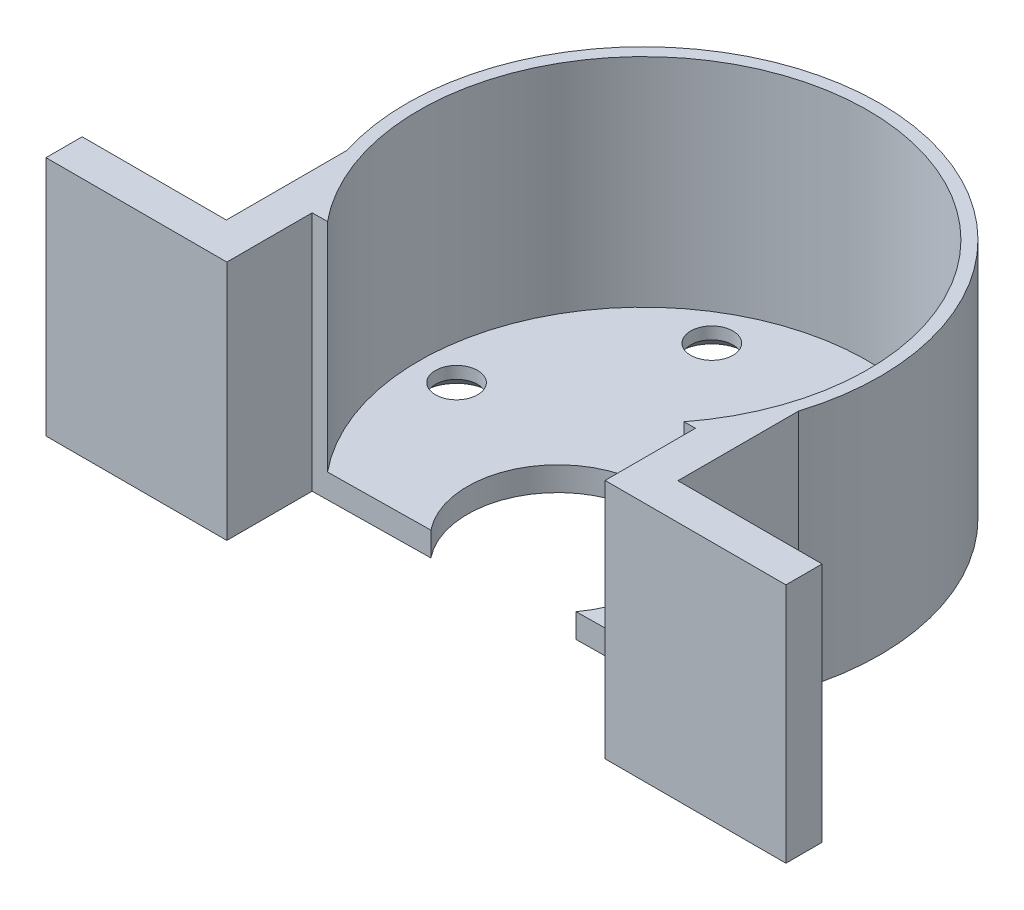
ISO-10303-21;
HEADER;
FILE_DESCRIPTION(('STEP AP214'),'2;1');
FILE_NAME('part.step','',(''),(''),'','','');
FILE_SCHEMA(('AUTOMOTIVE_DESIGN { 1 0 10303 214 1 1 1 1 }'));
ENDSEC;
DATA;
#1=APPLICATION_CONTEXT('core data for automotive mechanical design processes');
#2=APPLICATION_PROTOCOL_DEFINITION('international standard','automotive_design',2000,#1);
#3=PRODUCT_CONTEXT('',#1,'mechanical');
#4=PRODUCT('Part','Part','',(#3));
#5=PRODUCT_RELATED_PRODUCT_CATEGORY('part','',(#4));
#6=PRODUCT_DEFINITION_FORMATION('','',#4);
#7=PRODUCT_DEFINITION_CONTEXT('part definition',#1,'design');
#8=PRODUCT_DEFINITION('design','',#6,#7);
#9=PRODUCT_DEFINITION_SHAPE('','',#8);
#10=(LENGTH_UNIT() NAMED_UNIT(*) SI_UNIT(.MILLI.,.METRE.));
#11=(NAMED_UNIT(*) PLANE_ANGLE_UNIT() SI_UNIT($,.RADIAN.));
#12=(NAMED_UNIT(*) SI_UNIT($,.STERADIAN.) SOLID_ANGLE_UNIT());
#13=UNCERTAINTY_MEASURE_WITH_UNIT(LENGTH_MEASURE(1.E-05),#10,'distance_accuracy_value','');
#14=(GEOMETRIC_REPRESENTATION_CONTEXT(3) GLOBAL_UNCERTAINTY_ASSIGNED_CONTEXT((#13)) GLOBAL_UNIT_ASSIGNED_CONTEXT((#10,
#11,#12)) REPRESENTATION_CONTEXT('',''));
#15=CARTESIAN_POINT('',(0.,0.,0.));
#16=DIRECTION('',(0.,0.,1.));
#17=DIRECTION('',(1.,0.,0.));
#18=AXIS2_PLACEMENT_3D('',#15,#16,#17);
#19=CARTESIAN_POINT('',(0.,0.,0.));
#20=DIRECTION('',(0.,1.,0.));
#21=DIRECTION('',(0.,0.,1.));
#22=AXIS2_PLACEMENT_3D('',#19,#20,#21);
#23=PLANE('',#22);
#24=CARTESIAN_POINT('',(7.74999999999992,0.,-13.4233937586588));
#25=DIRECTION('',(0.,-1.,0.));
#26=DIRECTION('',(0.,0.,-1.));
#27=AXIS2_PLACEMENT_3D('',#24,#25,#26);
#28=CIRCLE('',#27,2.75);
#29=CARTESIAN_POINT('',(7.74999999999992,0.,-16.1733937586588));
#30=VERTEX_POINT('',#29);
#31=EDGE_CURVE('E609',#30,#30,#28,.T.);
#32=ORIENTED_EDGE('',*,*,#31,.F.);
#33=EDGE_LOOP('',(#32));
#34=FACE_BOUND('',#33,.T.);
#35=CARTESIAN_POINT('',(-7.75,0.,-13.4233937586597));
#36=DIRECTION('',(0.,-1.,0.));
#37=DIRECTION('',(0.,0.,-1.));
#38=AXIS2_PLACEMENT_3D('',#35,#36,#37);
#39=CIRCLE('',#38,2.75);
#40=CARTESIAN_POINT('',(-7.75,0.,-16.1733937586597));
#41=VERTEX_POINT('',#40);
#42=EDGE_CURVE('E252',#41,#41,#39,.T.);
#43=ORIENTED_EDGE('',*,*,#42,.F.);
#44=EDGE_LOOP('',(#43));
#45=FACE_BOUND('',#44,.T.);
#46=DIRECTION('',(0.999908014906101,0.,-0.0135632491144308));
#47=VECTOR('',#46,1.);
#48=CARTESIAN_POINT('',(0.157041345134713,0.,11.577380784429));
#49=LINE('',#48,#47);
#50=CARTESIAN_POINT('',(5.90549403913248,0.,11.4994059159922));
#51=VERTEX_POINT('',#50);
#52=CARTESIAN_POINT('',(15.6870120515816,0.,11.3667245457637));
#53=VERTEX_POINT('',#52);
#54=EDGE_CURVE('E168',#51,#53,#49,.T.);
#55=ORIENTED_EDGE('',*,*,#54,.F.);
#56=CARTESIAN_POINT('',(-0.0949514779216288,0.,7.00000000000001));
#57=DIRECTION('',(0.,1.,0.));
#58=DIRECTION('',(0.,0.,-1.));
#59=AXIS2_PLACEMENT_3D('',#56,#57,#58);
#60=CIRCLE('',#59,7.5);
#61=CARTESIAN_POINT('',(-5.97114739079831,0.,11.6605065812089));
#62=VERTEX_POINT('',#61);
#63=EDGE_CURVE('E153',#51,#62,#60,.T.);
#64=ORIENTED_EDGE('',*,*,#63,.T.);
#65=CARTESIAN_POINT('',(-15.6870120515816,0.,11.7922973967557));
#66=VERTEX_POINT('',#65);
#67=EDGE_CURVE('E165',#66,#62,#49,.T.);
#68=ORIENTED_EDGE('',*,*,#67,.F.);
#69=DIRECTION('',(0.,0.,1.));
#70=VECTOR('',#69,1.);
#71=CARTESIAN_POINT('',(-15.6870120515816,0.,0.));
#72=LINE('',#71,#70);
#73=CARTESIAN_POINT('',(-15.6870120515816,0.,18.8658479697375));
#74=VERTEX_POINT('',#73);
#75=EDGE_CURVE('E178',#66,#74,#72,.T.);
#76=ORIENTED_EDGE('',*,*,#75,.T.);
#77=DIRECTION('',(1.,0.,0.));
#78=VECTOR('',#77,1.);
#79=CARTESIAN_POINT('',(0.,0.,18.8658479697375));
#80=LINE('',#79,#78);
#81=CARTESIAN_POINT('',(-30.6870120515816,0.,18.8658479697375));
#82=VERTEX_POINT('',#81);
#83=EDGE_CURVE('E203',#82,#74,#80,.T.);
#84=ORIENTED_EDGE('',*,*,#83,.F.);
#85=DIRECTION('',(0.,0.,1.));
#86=VECTOR('',#85,1.);
#87=CARTESIAN_POINT('',(-30.6870120515816,0.,0.));
#88=LINE('',#87,#86);
#89=CARTESIAN_POINT('',(-30.6870120515816,0.,15.8658479697375));
#90=VERTEX_POINT('',#89);
#91=EDGE_CURVE('E201',#90,#82,#88,.T.);
#92=ORIENTED_EDGE('',*,*,#91,.F.);
#93=DIRECTION('',(-1.,0.,0.));
#94=VECTOR('',#93,1.);
#95=CARTESIAN_POINT('',(0.,0.,15.8658479697375));
#96=LINE('',#95,#94);
#97=CARTESIAN_POINT('',(-18.7278523220343,0.,15.8658479697375));
#98=VERTEX_POINT('',#97);
#99=EDGE_CURVE('E199',#98,#90,#96,.T.);
#100=ORIENTED_EDGE('',*,*,#99,.F.);
#101=DIRECTION('',(0.,0.,-1.));
#102=VECTOR('',#101,1.);
#103=CARTESIAN_POINT('',(-18.7278523220343,0.,0.));
#104=LINE('',#103,#102);
#105=CARTESIAN_POINT('',(-18.7278523220343,0.,5.86584796973752));
#106=VERTEX_POINT('',#105);
#107=EDGE_CURVE('E196',#98,#106,#104,.T.);
#108=ORIENTED_EDGE('',*,*,#107,.T.);
#109=CARTESIAN_POINT('',(0.,0.,0.));
#110=DIRECTION('',(0.,1.,0.));
#111=DIRECTION('',(0.,0.,1.));
#112=AXIS2_PLACEMENT_3D('',#109,#110,#111);
#113=CIRCLE('',#112,19.625);
#114=CARTESIAN_POINT('',(18.7278523220343,0.,5.86584796973752));
#115=VERTEX_POINT('',#114);
#116=EDGE_CURVE('E193',#115,#106,#113,.T.);
#117=ORIENTED_EDGE('',*,*,#116,.F.);
#118=DIRECTION('',(0.,0.,1.));
#119=VECTOR('',#118,1.);
#120=CARTESIAN_POINT('',(18.7278523220343,0.,0.));
#121=LINE('',#120,#119);
#122=CARTESIAN_POINT('',(18.7278523220343,0.,15.8658479697375));
#123=VERTEX_POINT('',#122);
#124=EDGE_CURVE('E190',#115,#123,#121,.T.);
#125=ORIENTED_EDGE('',*,*,#124,.T.);
#126=DIRECTION('',(1.,0.,0.));
#127=VECTOR('',#126,1.);
#128=CARTESIAN_POINT('',(0.,0.,15.8658479697375));
#129=LINE('',#128,#127);
#130=CARTESIAN_POINT('',(30.6870120515816,0.,15.8658479697375));
#131=VERTEX_POINT('',#130);
#132=EDGE_CURVE('E187',#123,#131,#129,.T.);
#133=ORIENTED_EDGE('',*,*,#132,.T.);
#134=DIRECTION('',(0.,0.,-1.));
#135=VECTOR('',#134,1.);
#136=CARTESIAN_POINT('',(30.6870120515816,0.,0.));
#137=LINE('',#136,#135);
#138=CARTESIAN_POINT('',(30.6870120515816,0.,18.8658479697375));
#139=VERTEX_POINT('',#138);
#140=EDGE_CURVE('E184',#139,#131,#137,.T.);
#141=ORIENTED_EDGE('',*,*,#140,.F.);
#142=DIRECTION('',(-1.,0.,0.));
#143=VECTOR('',#142,1.);
#144=CARTESIAN_POINT('',(0.,0.,18.8658479697375));
#145=LINE('',#144,#143);
#146=CARTESIAN_POINT('',(15.6870120515816,0.,18.8658479697375));
#147=VERTEX_POINT('',#146);
#148=EDGE_CURVE('E176',#139,#147,#145,.T.);
#149=ORIENTED_EDGE('',*,*,#148,.T.);
#150=DIRECTION('',(0.,0.,-1.));
#151=VECTOR('',#150,1.);
#152=CARTESIAN_POINT('',(15.6870120515816,0.,0.));
#153=LINE('',#152,#151);
#154=EDGE_CURVE('E174',#147,#53,#153,.T.);
#155=ORIENTED_EDGE('',*,*,#154,.T.);
#156=EDGE_LOOP('',(#55,#64,#68,#76,#84,#92,#100,#108,#117,#125,#133,#141,#149,#155));
#157=FACE_BOUND('',#156,.T.);
#158=CARTESIAN_POINT('',(15.4999999999992,0.,4.54598544954157E-13));
#159=DIRECTION('',(0.,-1.,0.));
#160=DIRECTION('',(0.,0.,-1.));
#161=AXIS2_PLACEMENT_3D('',#158,#159,#160);
#162=CIRCLE('',#161,2.75);
#163=CARTESIAN_POINT('',(15.4999999999992,0.,-2.74999999999954));
#164=VERTEX_POINT('',#163);
#165=EDGE_CURVE('E241',#164,#164,#162,.T.);
#166=ORIENTED_EDGE('',*,*,#165,.F.);
#167=EDGE_LOOP('',(#166));
#168=FACE_BOUND('',#167,.T.);
#169=CARTESIAN_POINT('',(-15.5000000000008,0.,-1.30721513339676E-12));
#170=DIRECTION('',(0.,-1.,0.));
#171=DIRECTION('',(0.,0.,-1.));
#172=AXIS2_PLACEMENT_3D('',#169,#170,#171);
#173=CIRCLE('',#172,2.75);
#174=CARTESIAN_POINT('',(-15.5000000000008,0.,-2.75000000000131));
#175=VERTEX_POINT('',#174);
#176=EDGE_CURVE('E245',#175,#175,#173,.T.);
#177=ORIENTED_EDGE('',*,*,#176,.F.);
#178=EDGE_LOOP('',(#177));
#179=FACE_BOUND('',#178,.T.);
#180=ADVANCED_FACE('F37',(#34,#45,#157,#168,#179),#23,.F.);
#181=CARTESIAN_POINT('',(0.157041345134713,20.,11.577380784429));
#182=DIRECTION('',(-0.0135632491144308,0.,-0.999908014906101));
#183=DIRECTION('',(-0.999908014906101,0.,0.0135632491144308));
#184=AXIS2_PLACEMENT_3D('',#181,#182,#183);
#185=PLANE('',#184);
#186=ORIENTED_EDGE('',*,*,#67,.T.);
#187=DIRECTION('',(0.,1.,0.));
#188=VECTOR('',#187,1.);
#189=CARTESIAN_POINT('',(-5.97114739079831,0.,11.6605065812089));
#190=LINE('',#189,#188);
#191=CARTESIAN_POINT('',(-5.97114739079831,2.,11.6605065812089));
#192=VERTEX_POINT('',#191);
#193=EDGE_CURVE('E150',#62,#192,#190,.T.);
#194=ORIENTED_EDGE('',*,*,#193,.T.);
#195=DIRECTION('',(0.999908014906101,0.,-0.0135632491144308));
#196=VECTOR('',#195,1.);
#197=CARTESIAN_POINT('',(0.157041345134713,2.,11.577380784429));
#198=LINE('',#197,#196);
#199=CARTESIAN_POINT('',(-14.4303184082284,2.,11.7752509797942));
#200=VERTEX_POINT('',#199);
#201=EDGE_CURVE('E46',#200,#192,#198,.T.);
#202=ORIENTED_EDGE('',*,*,#201,.F.);
#203=DIRECTION('',(0.,1.,0.));
#204=VECTOR('',#203,1.);
#205=CARTESIAN_POINT('',(-14.4303184082284,2.,11.7752509797942));
#206=LINE('',#205,#204);
#207=CARTESIAN_POINT('',(-14.4303184082284,20.,11.7752509797942));
#208=VERTEX_POINT('',#207);
#209=EDGE_CURVE('E272',#200,#208,#206,.T.);
#210=ORIENTED_EDGE('',*,*,#209,.T.);
#211=DIRECTION('',(0.999908014906101,0.,-0.0135632491144308));
#212=VECTOR('',#211,1.);
#213=CARTESIAN_POINT('',(0.157041345134713,20.,11.577380784429));
#214=LINE('',#213,#212);
#215=CARTESIAN_POINT('',(-15.6870120515816,20.,11.7922973967557));
#216=VERTEX_POINT('',#215);
#217=EDGE_CURVE('E278',#216,#208,#214,.T.);
#218=ORIENTED_EDGE('',*,*,#217,.F.);
#219=DIRECTION('',(0.,-1.,0.));
#220=VECTOR('',#219,1.);
#221=CARTESIAN_POINT('',(-15.6870120515816,20.,11.7922973967557));
#222=LINE('',#221,#220);
#223=EDGE_CURVE('E173',#216,#66,#222,.T.);
#224=ORIENTED_EDGE('',*,*,#223,.T.);
#225=EDGE_LOOP('',(#186,#194,#202,#210,#218,#224));
#226=FACE_BOUND('',#225,.T.);
#227=ADVANCED_FACE('F171',(#226),#185,.F.);
#228=CARTESIAN_POINT('',(-15.6870120515816,20.,0.));
#229=DIRECTION('',(1.,0.,0.));
#230=DIRECTION('',(0.,0.,-1.));
#231=AXIS2_PLACEMENT_3D('',#228,#229,#230);
#232=PLANE('',#231);
#233=ORIENTED_EDGE('',*,*,#75,.F.);
#234=ORIENTED_EDGE('',*,*,#223,.F.);
#235=DIRECTION('',(0.,0.,1.));
#236=VECTOR('',#235,1.);
#237=CARTESIAN_POINT('',(-15.6870120515816,20.,0.));
#238=LINE('',#237,#236);
#239=CARTESIAN_POINT('',(-15.6870120515816,20.,18.8658479697375));
#240=VERTEX_POINT('',#239);
#241=EDGE_CURVE('E206',#216,#240,#238,.T.);
#242=ORIENTED_EDGE('',*,*,#241,.T.);
#243=DIRECTION('',(0.,-1.,0.));
#244=VECTOR('',#243,1.);
#245=CARTESIAN_POINT('',(-15.6870120515816,20.,18.8658479697375));
#246=LINE('',#245,#244);
#247=EDGE_CURVE('E207',#240,#74,#246,.T.);
#248=ORIENTED_EDGE('',*,*,#247,.T.);
#249=EDGE_LOOP('',(#233,#234,#242,#248));
#250=FACE_BOUND('',#249,.T.);
#251=ADVANCED_FACE('F39',(#250),#232,.T.);
#252=CARTESIAN_POINT('',(5.90549403913248,2.,11.4994059159922));
#253=VERTEX_POINT('',#252);
#254=CARTESIAN_POINT('',(14.7444010984979,2.,11.3795105890638));
#255=VERTEX_POINT('',#254);
#256=EDGE_CURVE('E234',#253,#255,#198,.T.);
#257=ORIENTED_EDGE('',*,*,#256,.F.);
#258=DIRECTION('',(0.,1.,0.));
#259=VECTOR('',#258,1.);
#260=CARTESIAN_POINT('',(5.90549403913248,0.,11.4994059159922));
#261=LINE('',#260,#259);
#262=EDGE_CURVE('E53',#253,#51,#261,.F.);
#263=ORIENTED_EDGE('',*,*,#262,.T.);
#264=ORIENTED_EDGE('',*,*,#54,.T.);
#265=DIRECTION('',(0.,-1.,0.));
#266=VECTOR('',#265,1.);
#267=CARTESIAN_POINT('',(15.6870120515816,20.,11.3667245457637));
#268=LINE('',#267,#266);
#269=CARTESIAN_POINT('',(15.6870120515816,20.,11.3667245457637));
#270=VERTEX_POINT('',#269);
#271=EDGE_CURVE('E230',#270,#53,#268,.T.);
#272=ORIENTED_EDGE('',*,*,#271,.F.);
#273=CARTESIAN_POINT('',(14.7444010984979,20.,11.3795105890638));
#274=VERTEX_POINT('',#273);
#275=EDGE_CURVE('E277',#274,#270,#214,.T.);
#276=ORIENTED_EDGE('',*,*,#275,.F.);
#277=DIRECTION('',(0.,1.,0.));
#278=VECTOR('',#277,1.);
#279=CARTESIAN_POINT('',(14.7444010984979,2.,11.3795105890638));
#280=LINE('',#279,#278);
#281=EDGE_CURVE('E61',#274,#255,#280,.F.);
#282=ORIENTED_EDGE('',*,*,#281,.T.);
#283=EDGE_LOOP('',(#257,#263,#264,#272,#276,#282));
#284=FACE_BOUND('',#283,.T.);
#285=ADVANCED_FACE('F319',(#284),#185,.F.);
#286=CARTESIAN_POINT('',(15.6870120515816,20.,0.));
#287=DIRECTION('',(-1.,0.,0.));
#288=DIRECTION('',(0.,0.,1.));
#289=AXIS2_PLACEMENT_3D('',#286,#287,#288);
#290=PLANE('',#289);
#291=ORIENTED_EDGE('',*,*,#154,.F.);
#292=DIRECTION('',(0.,-1.,0.));
#293=VECTOR('',#292,1.);
#294=CARTESIAN_POINT('',(15.6870120515816,20.,18.8658479697375));
#295=LINE('',#294,#293);
#296=CARTESIAN_POINT('',(15.6870120515816,20.,18.8658479697375));
#297=VERTEX_POINT('',#296);
#298=EDGE_CURVE('E228',#297,#147,#295,.T.);
#299=ORIENTED_EDGE('',*,*,#298,.F.);
#300=DIRECTION('',(0.,0.,-1.));
#301=VECTOR('',#300,1.);
#302=CARTESIAN_POINT('',(15.6870120515816,20.,0.));
#303=LINE('',#302,#301);
#304=EDGE_CURVE('E281',#297,#270,#303,.T.);
#305=ORIENTED_EDGE('',*,*,#304,.T.);
#306=ORIENTED_EDGE('',*,*,#271,.T.);
#307=EDGE_LOOP('',(#291,#299,#305,#306));
#308=FACE_BOUND('',#307,.T.);
#309=ADVANCED_FACE('F322',(#308),#290,.T.);
#310=CARTESIAN_POINT('',(0.,20.,18.8658479697375));
#311=DIRECTION('',(0.,0.,1.));
#312=DIRECTION('',(1.,0.,0.));
#313=AXIS2_PLACEMENT_3D('',#310,#311,#312);
#314=PLANE('',#313);
#315=ORIENTED_EDGE('',*,*,#148,.F.);
#316=DIRECTION('',(0.,-1.,0.));
#317=VECTOR('',#316,1.);
#318=CARTESIAN_POINT('',(30.6870120515816,20.,18.8658479697375));
#319=LINE('',#318,#317);
#320=CARTESIAN_POINT('',(30.6870120515816,20.,18.8658479697375));
#321=VERTEX_POINT('',#320);
#322=EDGE_CURVE('E226',#321,#139,#319,.T.);
#323=ORIENTED_EDGE('',*,*,#322,.F.);
#324=DIRECTION('',(-1.,0.,0.));
#325=VECTOR('',#324,1.);
#326=CARTESIAN_POINT('',(0.,20.,18.8658479697375));
#327=LINE('',#326,#325);
#328=EDGE_CURVE('E284',#321,#297,#327,.T.);
#329=ORIENTED_EDGE('',*,*,#328,.T.);
#330=ORIENTED_EDGE('',*,*,#298,.T.);
#331=EDGE_LOOP('',(#315,#323,#329,#330));
#332=FACE_BOUND('',#331,.T.);
#333=ADVANCED_FACE('F326',(#332),#314,.T.);
#334=CARTESIAN_POINT('',(30.6870120515816,20.,0.));
#335=DIRECTION('',(-1.,0.,0.));
#336=DIRECTION('',(0.,0.,1.));
#337=AXIS2_PLACEMENT_3D('',#334,#335,#336);
#338=PLANE('',#337);
#339=ORIENTED_EDGE('',*,*,#140,.T.);
#340=DIRECTION('',(0.,-1.,0.));
#341=VECTOR('',#340,1.);
#342=CARTESIAN_POINT('',(30.6870120515816,20.,15.8658479697375));
#343=LINE('',#342,#341);
#344=CARTESIAN_POINT('',(30.6870120515816,20.,15.8658479697375));
#345=VERTEX_POINT('',#344);
#346=EDGE_CURVE('E224',#345,#131,#343,.T.);
#347=ORIENTED_EDGE('',*,*,#346,.F.);
#348=DIRECTION('',(0.,0.,-1.));
#349=VECTOR('',#348,1.);
#350=CARTESIAN_POINT('',(30.6870120515816,20.,0.));
#351=LINE('',#350,#349);
#352=EDGE_CURVE('E287',#321,#345,#351,.T.);
#353=ORIENTED_EDGE('',*,*,#352,.F.);
#354=ORIENTED_EDGE('',*,*,#322,.T.);
#355=EDGE_LOOP('',(#339,#347,#353,#354));
#356=FACE_BOUND('',#355,.T.);
#357=ADVANCED_FACE('F331',(#356),#338,.F.);
#358=CARTESIAN_POINT('',(0.,20.,15.8658479697375));
#359=DIRECTION('',(0.,0.,-1.));
#360=DIRECTION('',(-1.,0.,0.));
#361=AXIS2_PLACEMENT_3D('',#358,#359,#360);
#362=PLANE('',#361);
#363=ORIENTED_EDGE('',*,*,#132,.F.);
#364=DIRECTION('',(0.,-1.,0.));
#365=VECTOR('',#364,1.);
#366=CARTESIAN_POINT('',(18.7278523220343,20.,15.8658479697375));
#367=LINE('',#366,#365);
#368=CARTESIAN_POINT('',(18.7278523220343,20.,15.8658479697375));
#369=VERTEX_POINT('',#368);
#370=EDGE_CURVE('E222',#369,#123,#367,.T.);
#371=ORIENTED_EDGE('',*,*,#370,.F.);
#372=DIRECTION('',(1.,0.,0.));
#373=VECTOR('',#372,1.);
#374=CARTESIAN_POINT('',(0.,20.,15.8658479697375));
#375=LINE('',#374,#373);
#376=EDGE_CURVE('E289',#369,#345,#375,.T.);
#377=ORIENTED_EDGE('',*,*,#376,.T.);
#378=ORIENTED_EDGE('',*,*,#346,.T.);
#379=EDGE_LOOP('',(#363,#371,#377,#378));
#380=FACE_BOUND('',#379,.T.);
#381=ADVANCED_FACE('F356',(#380),#362,.T.);
#382=CARTESIAN_POINT('',(18.7278523220343,20.,0.));
#383=DIRECTION('',(1.,0.,0.));
#384=DIRECTION('',(0.,0.,-1.));
#385=AXIS2_PLACEMENT_3D('',#382,#383,#384);
#386=PLANE('',#385);
#387=ORIENTED_EDGE('',*,*,#124,.F.);
#388=DIRECTION('',(0.,-1.,0.));
#389=VECTOR('',#388,1.);
#390=CARTESIAN_POINT('',(18.7278523220343,20.,5.86584796973752));
#391=LINE('',#390,#389);
#392=CARTESIAN_POINT('',(18.7278523220343,20.,5.86584796973752));
#393=VERTEX_POINT('',#392);
#394=EDGE_CURVE('E220',#393,#115,#391,.T.);
#395=ORIENTED_EDGE('',*,*,#394,.F.);
#396=DIRECTION('',(0.,0.,1.));
#397=VECTOR('',#396,1.);
#398=CARTESIAN_POINT('',(18.7278523220343,20.,0.));
#399=LINE('',#398,#397);
#400=EDGE_CURVE('E292',#393,#369,#399,.T.);
#401=ORIENTED_EDGE('',*,*,#400,.T.);
#402=ORIENTED_EDGE('',*,*,#370,.T.);
#403=EDGE_LOOP('',(#387,#395,#401,#402));
#404=FACE_BOUND('',#403,.T.);
#405=ADVANCED_FACE('F337',(#404),#386,.T.);
#406=CARTESIAN_POINT('',(0.,20.,0.));
#407=DIRECTION('',(0.,-1.,0.));
#408=DIRECTION('',(0.,0.,-1.));
#409=AXIS2_PLACEMENT_3D('',#406,#407,#408);
#410=CYLINDRICAL_SURFACE('',#409,19.625);
#411=ORIENTED_EDGE('',*,*,#116,.T.);
#412=DIRECTION('',(0.,-1.,0.));
#413=VECTOR('',#412,1.);
#414=CARTESIAN_POINT('',(-18.7278523220343,20.,5.86584796973752));
#415=LINE('',#414,#413);
#416=CARTESIAN_POINT('',(-18.7278523220343,20.,5.86584796973752));
#417=VERTEX_POINT('',#416);
#418=EDGE_CURVE('E218',#417,#106,#415,.T.);
#419=ORIENTED_EDGE('',*,*,#418,.F.);
#420=CARTESIAN_POINT('',(0.,20.,0.));
#421=DIRECTION('',(0.,1.,0.));
#422=DIRECTION('',(0.,0.,1.));
#423=AXIS2_PLACEMENT_3D('',#420,#421,#422);
#424=CIRCLE('',#423,19.625);
#425=EDGE_CURVE('E295',#393,#417,#424,.T.);
#426=ORIENTED_EDGE('',*,*,#425,.F.);
#427=ORIENTED_EDGE('',*,*,#394,.T.);
#428=EDGE_LOOP('',(#411,#419,#426,#427));
#429=FACE_BOUND('',#428,.T.);
#430=ADVANCED_FACE('F343',(#429),#410,.T.);
#431=CARTESIAN_POINT('',(-18.7278523220343,20.,0.));
#432=DIRECTION('',(-1.,0.,0.));
#433=DIRECTION('',(0.,0.,1.));
#434=AXIS2_PLACEMENT_3D('',#431,#432,#433);
#435=PLANE('',#434);
#436=ORIENTED_EDGE('',*,*,#107,.F.);
#437=DIRECTION('',(0.,-1.,0.));
#438=VECTOR('',#437,1.);
#439=CARTESIAN_POINT('',(-18.7278523220343,20.,15.8658479697375));
#440=LINE('',#439,#438);
#441=CARTESIAN_POINT('',(-18.7278523220343,20.,15.8658479697375));
#442=VERTEX_POINT('',#441);
#443=EDGE_CURVE('E216',#442,#98,#440,.T.);
#444=ORIENTED_EDGE('',*,*,#443,.F.);
#445=DIRECTION('',(0.,0.,-1.));
#446=VECTOR('',#445,1.);
#447=CARTESIAN_POINT('',(-18.7278523220343,20.,0.));
#448=LINE('',#447,#446);
#449=EDGE_CURVE('E297',#442,#417,#448,.T.);
#450=ORIENTED_EDGE('',*,*,#449,.T.);
#451=ORIENTED_EDGE('',*,*,#418,.T.);
#452=EDGE_LOOP('',(#436,#444,#450,#451));
#453=FACE_BOUND('',#452,.T.);
#454=ADVANCED_FACE('F349',(#453),#435,.T.);
#455=CARTESIAN_POINT('',(0.,20.,15.8658479697375));
#456=DIRECTION('',(0.,0.,1.));
#457=DIRECTION('',(1.,0.,0.));
#458=AXIS2_PLACEMENT_3D('',#455,#456,#457);
#459=PLANE('',#458);
#460=ORIENTED_EDGE('',*,*,#99,.T.);
#461=DIRECTION('',(0.,-1.,0.));
#462=VECTOR('',#461,1.);
#463=CARTESIAN_POINT('',(-30.6870120515816,20.,15.8658479697375));
#464=LINE('',#463,#462);
#465=CARTESIAN_POINT('',(-30.6870120515816,20.,15.8658479697375));
#466=VERTEX_POINT('',#465);
#467=EDGE_CURVE('E213',#466,#90,#464,.T.);
#468=ORIENTED_EDGE('',*,*,#467,.F.);
#469=DIRECTION('',(-1.,0.,0.));
#470=VECTOR('',#469,1.);
#471=CARTESIAN_POINT('',(0.,20.,15.8658479697375));
#472=LINE('',#471,#470);
#473=EDGE_CURVE('E300',#442,#466,#472,.T.);
#474=ORIENTED_EDGE('',*,*,#473,.F.);
#475=ORIENTED_EDGE('',*,*,#443,.T.);
#476=EDGE_LOOP('',(#460,#468,#474,#475));
#477=FACE_BOUND('',#476,.T.);
#478=ADVANCED_FACE('F352',(#477),#459,.F.);
#479=CARTESIAN_POINT('',(-30.6870120515816,20.,0.));
#480=DIRECTION('',(1.,0.,0.));
#481=DIRECTION('',(0.,0.,-1.));
#482=AXIS2_PLACEMENT_3D('',#479,#480,#481);
#483=PLANE('',#482);
#484=ORIENTED_EDGE('',*,*,#91,.T.);
#485=DIRECTION('',(0.,-1.,0.));
#486=VECTOR('',#485,1.);
#487=CARTESIAN_POINT('',(-30.6870120515816,20.,18.8658479697375));
#488=LINE('',#487,#486);
#489=CARTESIAN_POINT('',(-30.6870120515816,20.,18.8658479697375));
#490=VERTEX_POINT('',#489);
#491=EDGE_CURVE('E209',#490,#82,#488,.T.);
#492=ORIENTED_EDGE('',*,*,#491,.F.);
#493=DIRECTION('',(0.,0.,1.));
#494=VECTOR('',#493,1.);
#495=CARTESIAN_POINT('',(-30.6870120515816,20.,0.));
#496=LINE('',#495,#494);
#497=EDGE_CURVE('E302',#466,#490,#496,.T.);
#498=ORIENTED_EDGE('',*,*,#497,.F.);
#499=ORIENTED_EDGE('',*,*,#467,.T.);
#500=EDGE_LOOP('',(#484,#492,#498,#499));
#501=FACE_BOUND('',#500,.T.);
#502=ADVANCED_FACE('F355',(#501),#483,.F.);
#503=CARTESIAN_POINT('',(0.,20.,18.8658479697375));
#504=DIRECTION('',(0.,0.,-1.));
#505=DIRECTION('',(-1.,0.,0.));
#506=AXIS2_PLACEMENT_3D('',#503,#504,#505);
#507=PLANE('',#506);
#508=ORIENTED_EDGE('',*,*,#83,.T.);
#509=ORIENTED_EDGE('',*,*,#247,.F.);
#510=DIRECTION('',(1.,0.,0.));
#511=VECTOR('',#510,1.);
#512=CARTESIAN_POINT('',(0.,20.,18.8658479697375));
#513=LINE('',#512,#511);
#514=EDGE_CURVE('E210',#490,#240,#513,.T.);
#515=ORIENTED_EDGE('',*,*,#514,.F.);
#516=ORIENTED_EDGE('',*,*,#491,.T.);
#517=EDGE_LOOP('',(#508,#509,#515,#516));
#518=FACE_BOUND('',#517,.T.);
#519=ADVANCED_FACE('F311',(#518),#507,.F.);
#520=CARTESIAN_POINT('',(0.,20.,0.));
#521=DIRECTION('',(0.,1.,0.));
#522=DIRECTION('',(0.,0.,1.));
#523=AXIS2_PLACEMENT_3D('',#520,#521,#522);
#524=PLANE('',#523);
#525=CARTESIAN_POINT('',(0.,20.,0.));
#526=DIRECTION('',(0.,1.,0.));
#527=DIRECTION('',(0.,0.,1.));
#528=AXIS2_PLACEMENT_3D('',#525,#526,#527);
#529=CIRCLE('',#528,18.625);
#530=EDGE_CURVE('E158',#274,#208,#529,.T.);
#531=ORIENTED_EDGE('',*,*,#530,.F.);
#532=ORIENTED_EDGE('',*,*,#275,.T.);
#533=ORIENTED_EDGE('',*,*,#304,.F.);
#534=ORIENTED_EDGE('',*,*,#328,.F.);
#535=ORIENTED_EDGE('',*,*,#352,.T.);
#536=ORIENTED_EDGE('',*,*,#376,.F.);
#537=ORIENTED_EDGE('',*,*,#400,.F.);
#538=ORIENTED_EDGE('',*,*,#425,.T.);
#539=ORIENTED_EDGE('',*,*,#449,.F.);
#540=ORIENTED_EDGE('',*,*,#473,.T.);
#541=ORIENTED_EDGE('',*,*,#497,.T.);
#542=ORIENTED_EDGE('',*,*,#514,.T.);
#543=ORIENTED_EDGE('',*,*,#241,.F.);
#544=ORIENTED_EDGE('',*,*,#217,.T.);
#545=EDGE_LOOP('',(#531,#532,#533,#534,#535,#536,#537,#538,#539,#540,#541,#542,#543,#544));
#546=FACE_BOUND('',#545,.T.);
#547=ADVANCED_FACE('F307',(#546),#524,.T.);
#548=CARTESIAN_POINT('',(0.,2.,0.));
#549=DIRECTION('',(0.,1.,0.));
#550=DIRECTION('',(0.,0.,1.));
#551=AXIS2_PLACEMENT_3D('',#548,#549,#550);
#552=PLANE('',#551);
#553=CARTESIAN_POINT('',(7.74999999999992,2.,-13.4233937586588));
#554=DIRECTION('',(0.,1.,0.));
#555=DIRECTION('',(0.,0.,1.));
#556=AXIS2_PLACEMENT_3D('',#553,#554,#555);
#557=CIRCLE('',#556,1.74999999999999);
#558=CARTESIAN_POINT('',(7.74999999999992,2.,-11.6733937586589));
#559=VERTEX_POINT('',#558);
#560=EDGE_CURVE('E41',#559,#559,#557,.T.);
#561=ORIENTED_EDGE('',*,*,#560,.F.);
#562=EDGE_LOOP('',(#561));
#563=FACE_BOUND('',#562,.T.);
#564=CARTESIAN_POINT('',(-7.75,2.,-13.4233937586597));
#565=DIRECTION('',(0.,1.,0.));
#566=DIRECTION('',(0.,0.,1.));
#567=AXIS2_PLACEMENT_3D('',#564,#565,#566);
#568=CIRCLE('',#567,1.74999999999999);
#569=CARTESIAN_POINT('',(-7.75,2.,-11.6733937586597));
#570=VERTEX_POINT('',#569);
#571=EDGE_CURVE('E243',#570,#570,#568,.T.);
#572=ORIENTED_EDGE('',*,*,#571,.F.);
#573=EDGE_LOOP('',(#572));
#574=FACE_BOUND('',#573,.T.);
#575=CARTESIAN_POINT('',(-15.5000000000008,2.,-1.30721513339676E-12));
#576=DIRECTION('',(0.,1.,0.));
#577=DIRECTION('',(0.,0.,1.));
#578=AXIS2_PLACEMENT_3D('',#575,#576,#577);
#579=CIRCLE('',#578,1.74999999999999);
#580=CARTESIAN_POINT('',(-15.5000000000008,2.,1.74999999999868));
#581=VERTEX_POINT('',#580);
#582=EDGE_CURVE('E239',#581,#581,#579,.T.);
#583=ORIENTED_EDGE('',*,*,#582,.F.);
#584=EDGE_LOOP('',(#583));
#585=FACE_BOUND('',#584,.T.);
#586=CARTESIAN_POINT('',(15.4999999999992,2.,4.54598544954157E-13));
#587=DIRECTION('',(0.,1.,0.));
#588=DIRECTION('',(0.,0.,1.));
#589=AXIS2_PLACEMENT_3D('',#586,#587,#588);
#590=CIRCLE('',#589,1.74999999999999);
#591=CARTESIAN_POINT('',(15.4999999999992,2.,1.75000000000045));
#592=VERTEX_POINT('',#591);
#593=EDGE_CURVE('E169',#592,#592,#590,.T.);
#594=ORIENTED_EDGE('',*,*,#593,.F.);
#595=EDGE_LOOP('',(#594));
#596=FACE_BOUND('',#595,.T.);
#597=CARTESIAN_POINT('',(-0.0949514779216288,2.,7.00000000000001));
#598=DIRECTION('',(0.,1.,0.));
#599=DIRECTION('',(0.,0.,1.));
#600=AXIS2_PLACEMENT_3D('',#597,#598,#599);
#601=CIRCLE('',#600,7.5);
#602=EDGE_CURVE('E11',#253,#192,#601,.T.);
#603=ORIENTED_EDGE('',*,*,#602,.F.);
#604=ORIENTED_EDGE('',*,*,#256,.T.);
#605=CARTESIAN_POINT('',(0.,2.,0.));
#606=DIRECTION('',(0.,1.,0.));
#607=DIRECTION('',(0.,0.,1.));
#608=AXIS2_PLACEMENT_3D('',#605,#606,#607);
#609=CIRCLE('',#608,18.625);
#610=EDGE_CURVE('E267',#255,#200,#609,.T.);
#611=ORIENTED_EDGE('',*,*,#610,.T.);
#612=ORIENTED_EDGE('',*,*,#201,.T.);
#613=EDGE_LOOP('',(#603,#604,#611,#612));
#614=FACE_BOUND('',#613,.T.);
#615=ADVANCED_FACE('F411',(#563,#574,#585,#596,#614),#552,.T.);
#616=CARTESIAN_POINT('',(0.,2.,0.));
#617=DIRECTION('',(0.,1.,0.));
#618=DIRECTION('',(0.,0.,1.));
#619=AXIS2_PLACEMENT_3D('',#616,#617,#618);
#620=CYLINDRICAL_SURFACE('',#619,18.625);
#621=ORIENTED_EDGE('',*,*,#610,.F.);
#622=ORIENTED_EDGE('',*,*,#281,.F.);
#623=ORIENTED_EDGE('',*,*,#530,.T.);
#624=ORIENTED_EDGE('',*,*,#209,.F.);
#625=EDGE_LOOP('',(#621,#622,#623,#624));
#626=FACE_BOUND('',#625,.T.);
#627=ADVANCED_FACE('F418',(#626),#620,.F.);
#628=CARTESIAN_POINT('',(-0.0949514779216288,0.,7.00000000000001));
#629=DIRECTION('',(0.,1.,0.));
#630=DIRECTION('',(0.,0.,1.));
#631=AXIS2_PLACEMENT_3D('',#628,#629,#630);
#632=CYLINDRICAL_SURFACE('',#631,7.5);
#633=ORIENTED_EDGE('',*,*,#63,.F.);
#634=ORIENTED_EDGE('',*,*,#262,.F.);
#635=ORIENTED_EDGE('',*,*,#602,.T.);
#636=ORIENTED_EDGE('',*,*,#193,.F.);
#637=EDGE_LOOP('',(#633,#634,#635,#636));
#638=FACE_BOUND('',#637,.T.);
#639=ADVANCED_FACE('F152',(#638),#632,.F.);
#640=CARTESIAN_POINT('',(15.4999999999992,0.,4.54598544954157E-13));
#641=DIRECTION('',(0.,-1.,0.));
#642=DIRECTION('',(0.,0.,-1.));
#643=AXIS2_PLACEMENT_3D('',#640,#641,#642);
#644=CYLINDRICAL_SURFACE('',#643,1.74999999999999);
#645=ORIENTED_EDGE('',*,*,#593,.T.);
#646=EDGE_LOOP('',(#645));
#647=FACE_BOUND('',#646,.T.);
#648=CARTESIAN_POINT('',(15.4999999999992,1.,4.54598544954157E-13));
#649=DIRECTION('',(0.,-1.,0.));
#650=DIRECTION('',(0.,0.,-1.));
#651=AXIS2_PLACEMENT_3D('',#648,#649,#650);
#652=CIRCLE('',#651,1.75);
#653=CARTESIAN_POINT('',(15.4999999999992,1.,-1.74999999999954));
#654=VERTEX_POINT('',#653);
#655=EDGE_CURVE('E238',#654,#654,#652,.T.);
#656=ORIENTED_EDGE('',*,*,#655,.T.);
#657=EDGE_LOOP('',(#656));
#658=FACE_BOUND('',#657,.T.);
#659=ADVANCED_FACE('F432',(#647,#658),#644,.F.);
#660=CARTESIAN_POINT('',(15.4999999999992,0.,4.54598544954157E-13));
#661=DIRECTION('',(0.,-1.,0.));
#662=DIRECTION('',(0.,0.,-1.));
#663=AXIS2_PLACEMENT_3D('',#660,#661,#662);
#664=CONICAL_SURFACE('',#663,2.75,0.785398163397447);
#665=ORIENTED_EDGE('',*,*,#655,.F.);
#666=EDGE_LOOP('',(#665));
#667=FACE_BOUND('',#666,.T.);
#668=ORIENTED_EDGE('',*,*,#165,.T.);
#669=EDGE_LOOP('',(#668));
#670=FACE_BOUND('',#669,.T.);
#671=ADVANCED_FACE('F439',(#667,#670),#664,.F.);
#672=CARTESIAN_POINT('',(-15.5000000000008,0.,-1.30721513339676E-12));
#673=DIRECTION('',(0.,-1.,0.));
#674=DIRECTION('',(0.,0.,-1.));
#675=AXIS2_PLACEMENT_3D('',#672,#673,#674);
#676=CYLINDRICAL_SURFACE('',#675,1.74999999999999);
#677=ORIENTED_EDGE('',*,*,#582,.T.);
#678=EDGE_LOOP('',(#677));
#679=FACE_BOUND('',#678,.T.);
#680=CARTESIAN_POINT('',(-15.5000000000008,1.,-1.30721513339676E-12));
#681=DIRECTION('',(0.,-1.,0.));
#682=DIRECTION('',(0.,0.,-1.));
#683=AXIS2_PLACEMENT_3D('',#680,#681,#682);
#684=CIRCLE('',#683,1.75);
#685=CARTESIAN_POINT('',(-15.5000000000008,1.,-1.75000000000131));
#686=VERTEX_POINT('',#685);
#687=EDGE_CURVE('E242',#686,#686,#684,.T.);
#688=ORIENTED_EDGE('',*,*,#687,.T.);
#689=EDGE_LOOP('',(#688));
#690=FACE_BOUND('',#689,.T.);
#691=ADVANCED_FACE('F447',(#679,#690),#676,.F.);
#692=CARTESIAN_POINT('',(-15.5000000000008,0.,-1.30721513339676E-12));
#693=DIRECTION('',(0.,-1.,0.));
#694=DIRECTION('',(0.,0.,-1.));
#695=AXIS2_PLACEMENT_3D('',#692,#693,#694);
#696=CONICAL_SURFACE('',#695,2.75,0.785398163397447);
#697=ORIENTED_EDGE('',*,*,#687,.F.);
#698=EDGE_LOOP('',(#697));
#699=FACE_BOUND('',#698,.T.);
#700=ORIENTED_EDGE('',*,*,#176,.T.);
#701=EDGE_LOOP('',(#700));
#702=FACE_BOUND('',#701,.T.);
#703=ADVANCED_FACE('F455',(#699,#702),#696,.F.);
#704=CARTESIAN_POINT('',(-7.75,0.,-13.4233937586597));
#705=DIRECTION('',(0.,-1.,0.));
#706=DIRECTION('',(0.,0.,-1.));
#707=AXIS2_PLACEMENT_3D('',#704,#705,#706);
#708=CYLINDRICAL_SURFACE('',#707,1.74999999999999);
#709=ORIENTED_EDGE('',*,*,#571,.T.);
#710=EDGE_LOOP('',(#709));
#711=FACE_BOUND('',#710,.T.);
#712=CARTESIAN_POINT('',(-7.75,1.,-13.4233937586597));
#713=DIRECTION('',(0.,-1.,0.));
#714=DIRECTION('',(0.,0.,-1.));
#715=AXIS2_PLACEMENT_3D('',#712,#713,#714);
#716=CIRCLE('',#715,1.75);
#717=CARTESIAN_POINT('',(-7.75,1.,-15.1733937586597));
#718=VERTEX_POINT('',#717);
#719=EDGE_CURVE('E246',#718,#718,#716,.T.);
#720=ORIENTED_EDGE('',*,*,#719,.T.);
#721=EDGE_LOOP('',(#720));
#722=FACE_BOUND('',#721,.T.);
#723=ADVANCED_FACE('F463',(#711,#722),#708,.F.);
#724=CARTESIAN_POINT('',(-7.75,0.,-13.4233937586597));
#725=DIRECTION('',(0.,-1.,0.));
#726=DIRECTION('',(0.,0.,-1.));
#727=AXIS2_PLACEMENT_3D('',#724,#725,#726);
#728=CONICAL_SURFACE('',#727,2.75,0.785398163397448);
#729=ORIENTED_EDGE('',*,*,#719,.F.);
#730=EDGE_LOOP('',(#729));
#731=FACE_BOUND('',#730,.T.);
#732=ORIENTED_EDGE('',*,*,#42,.T.);
#733=EDGE_LOOP('',(#732));
#734=FACE_BOUND('',#733,.T.);
#735=ADVANCED_FACE('F471',(#731,#734),#728,.F.);
#736=CARTESIAN_POINT('',(7.74999999999992,0.,-13.4233937586588));
#737=DIRECTION('',(0.,-1.,0.));
#738=DIRECTION('',(0.,0.,-1.));
#739=AXIS2_PLACEMENT_3D('',#736,#737,#738);
#740=CYLINDRICAL_SURFACE('',#739,1.74999999999999);
#741=ORIENTED_EDGE('',*,*,#560,.T.);
#742=EDGE_LOOP('',(#741));
#743=FACE_BOUND('',#742,.T.);
#744=CARTESIAN_POINT('',(7.74999999999992,1.,-13.4233937586588));
#745=DIRECTION('',(0.,-1.,0.));
#746=DIRECTION('',(0.,0.,-1.));
#747=AXIS2_PLACEMENT_3D('',#744,#745,#746);
#748=CIRCLE('',#747,1.75);
#749=CARTESIAN_POINT('',(7.74999999999992,1.,-15.1733937586588));
#750=VERTEX_POINT('',#749);
#751=EDGE_CURVE('E607',#750,#750,#748,.T.);
#752=ORIENTED_EDGE('',*,*,#751,.T.);
#753=EDGE_LOOP('',(#752));
#754=FACE_BOUND('',#753,.T.);
#755=ADVANCED_FACE('F478',(#743,#754),#740,.F.);
#756=CARTESIAN_POINT('',(7.74999999999992,0.,-13.4233937586588));
#757=DIRECTION('',(0.,-1.,0.));
#758=DIRECTION('',(0.,0.,-1.));
#759=AXIS2_PLACEMENT_3D('',#756,#757,#758);
#760=CONICAL_SURFACE('',#759,2.75,0.785398163397447);
#761=ORIENTED_EDGE('',*,*,#751,.F.);
#762=EDGE_LOOP('',(#761));
#763=FACE_BOUND('',#762,.T.);
#764=ORIENTED_EDGE('',*,*,#31,.T.);
#765=EDGE_LOOP('',(#764));
#766=FACE_BOUND('',#765,.T.);
#767=ADVANCED_FACE('F486',(#763,#766),#760,.F.);
#768=CLOSED_SHELL('',(#180,#227,#251,#285,#309,#333,#357,#381,#405,#430,#454,#478,#502,#519,
#547,#615,#627,#639,#659,#671,#691,#703,#723,#735,#755,#767));
#769=MANIFOLD_SOLID_BREP('B2',#768);
#770=ADVANCED_BREP_SHAPE_REPRESENTATION('',(#18,#769),#14);
#771=SHAPE_DEFINITION_REPRESENTATION(#9,#770);
ENDSEC;
END-ISO-10303-21;
